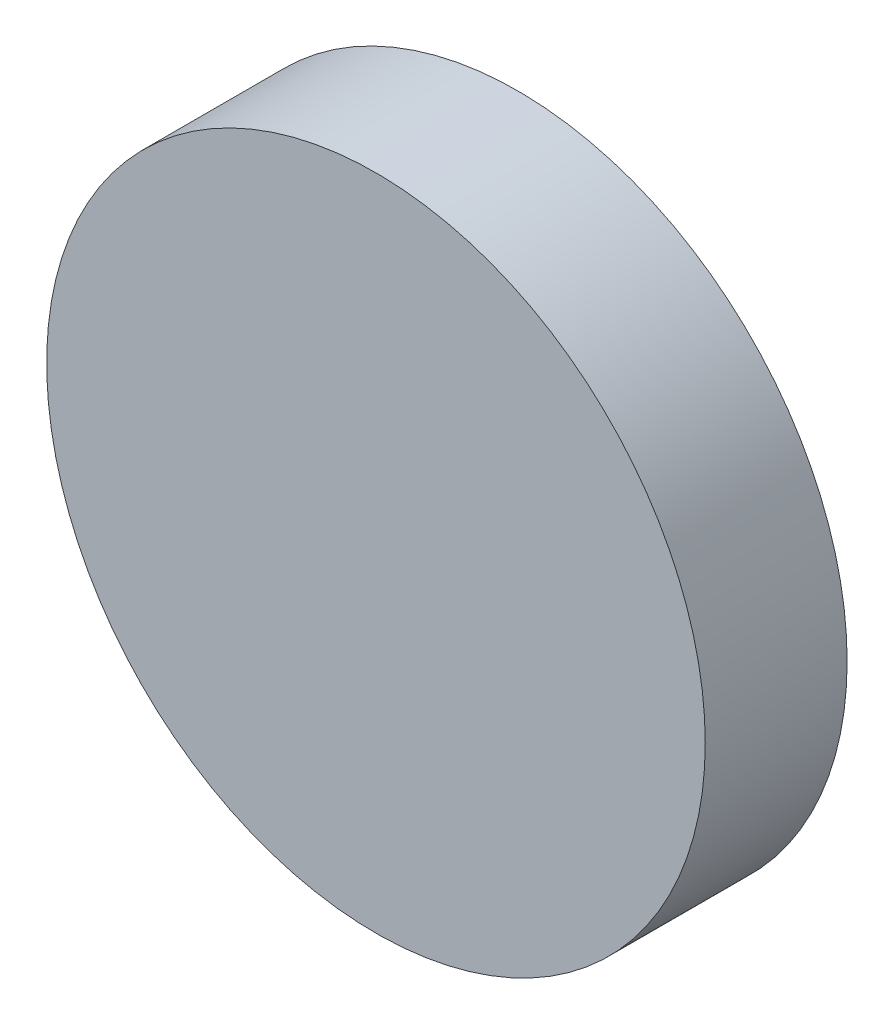
ISO-10303-21;
HEADER;
FILE_DESCRIPTION(('STEP AP214'),'2;1');
FILE_NAME('part.step','',(''),(''),'','','');
FILE_SCHEMA(('AUTOMOTIVE_DESIGN { 1 0 10303 214 1 1 1 1 }'));
ENDSEC;
DATA;
#1=APPLICATION_CONTEXT('core data for automotive mechanical design processes');
#2=APPLICATION_PROTOCOL_DEFINITION('international standard','automotive_design',2000,#1);
#3=PRODUCT_CONTEXT('',#1,'mechanical');
#4=PRODUCT('Part','Part','',(#3));
#5=PRODUCT_RELATED_PRODUCT_CATEGORY('part','',(#4));
#6=PRODUCT_DEFINITION_FORMATION('','',#4);
#7=PRODUCT_DEFINITION_CONTEXT('part definition',#1,'design');
#8=PRODUCT_DEFINITION('design','',#6,#7);
#9=PRODUCT_DEFINITION_SHAPE('','',#8);
#10=(LENGTH_UNIT() NAMED_UNIT(*) SI_UNIT(.MILLI.,.METRE.));
#11=(NAMED_UNIT(*) PLANE_ANGLE_UNIT() SI_UNIT($,.RADIAN.));
#12=(NAMED_UNIT(*) SI_UNIT($,.STERADIAN.) SOLID_ANGLE_UNIT());
#13=UNCERTAINTY_MEASURE_WITH_UNIT(LENGTH_MEASURE(1.E-05),#10,'distance_accuracy_value','');
#14=(GEOMETRIC_REPRESENTATION_CONTEXT(3) GLOBAL_UNCERTAINTY_ASSIGNED_CONTEXT((#13)) GLOBAL_UNIT_ASSIGNED_CONTEXT((#10,
#11,#12)) REPRESENTATION_CONTEXT('',''));
#15=CARTESIAN_POINT('',(0.,0.,0.));
#16=DIRECTION('',(0.,0.,1.));
#17=DIRECTION('',(1.,0.,0.));
#18=AXIS2_PLACEMENT_3D('',#15,#16,#17);
#19=CARTESIAN_POINT('',(0.,0.,6.));
#20=DIRECTION('',(0.,0.,-1.));
#21=DIRECTION('',(-1.,0.,0.));
#22=AXIS2_PLACEMENT_3D('',#19,#20,#21);
#23=CYLINDRICAL_SURFACE('',#22,13.925);
#24=CARTESIAN_POINT('',(0.,0.,6.));
#25=DIRECTION('',(0.,0.,1.));
#26=DIRECTION('',(1.,0.,0.));
#27=AXIS2_PLACEMENT_3D('',#24,#25,#26);
#28=CIRCLE('',#27,13.925);
#29=CARTESIAN_POINT('',(13.925,0.,6.));
#30=VERTEX_POINT('',#29);
#31=EDGE_CURVE('E10',#30,#30,#28,.T.);
#32=ORIENTED_EDGE('',*,*,#31,.F.);
#33=EDGE_LOOP('',(#32));
#34=FACE_BOUND('',#33,.T.);
#35=CARTESIAN_POINT('',(0.,0.,0.));
#36=DIRECTION('',(0.,0.,1.));
#37=DIRECTION('',(1.,0.,0.));
#38=AXIS2_PLACEMENT_3D('',#35,#36,#37);
#39=CIRCLE('',#38,13.925);
#40=CARTESIAN_POINT('',(13.925,0.,0.));
#41=VERTEX_POINT('',#40);
#42=EDGE_CURVE('E34',#41,#41,#39,.T.);
#43=ORIENTED_EDGE('',*,*,#42,.T.);
#44=EDGE_LOOP('',(#43));
#45=FACE_BOUND('',#44,.T.);
#46=ADVANCED_FACE('F31',(#34,#45),#23,.T.);
#47=CARTESIAN_POINT('',(0.,0.,6.));
#48=DIRECTION('',(0.,0.,1.));
#49=DIRECTION('',(1.,0.,0.));
#50=AXIS2_PLACEMENT_3D('',#47,#48,#49);
#51=PLANE('',#50);
#52=ORIENTED_EDGE('',*,*,#31,.T.);
#53=EDGE_LOOP('',(#52));
#54=FACE_BOUND('',#53,.T.);
#55=ADVANCED_FACE('F46',(#54),#51,.T.);
#56=CARTESIAN_POINT('',(0.,0.,0.));
#57=DIRECTION('',(0.,0.,1.));
#58=DIRECTION('',(1.,0.,0.));
#59=AXIS2_PLACEMENT_3D('',#56,#57,#58);
#60=PLANE('',#59);
#61=ORIENTED_EDGE('',*,*,#42,.F.);
#62=EDGE_LOOP('',(#61));
#63=FACE_BOUND('',#62,.T.);
#64=ADVANCED_FACE('F44',(#63),#60,.F.);
#65=CLOSED_SHELL('',(#46,#55,#64));
#66=MANIFOLD_SOLID_BREP('B2',#65);
#67=ADVANCED_BREP_SHAPE_REPRESENTATION('',(#18,#66),#14);
#68=SHAPE_DEFINITION_REPRESENTATION(#9,#67);
ENDSEC;
END-ISO-10303-21;
